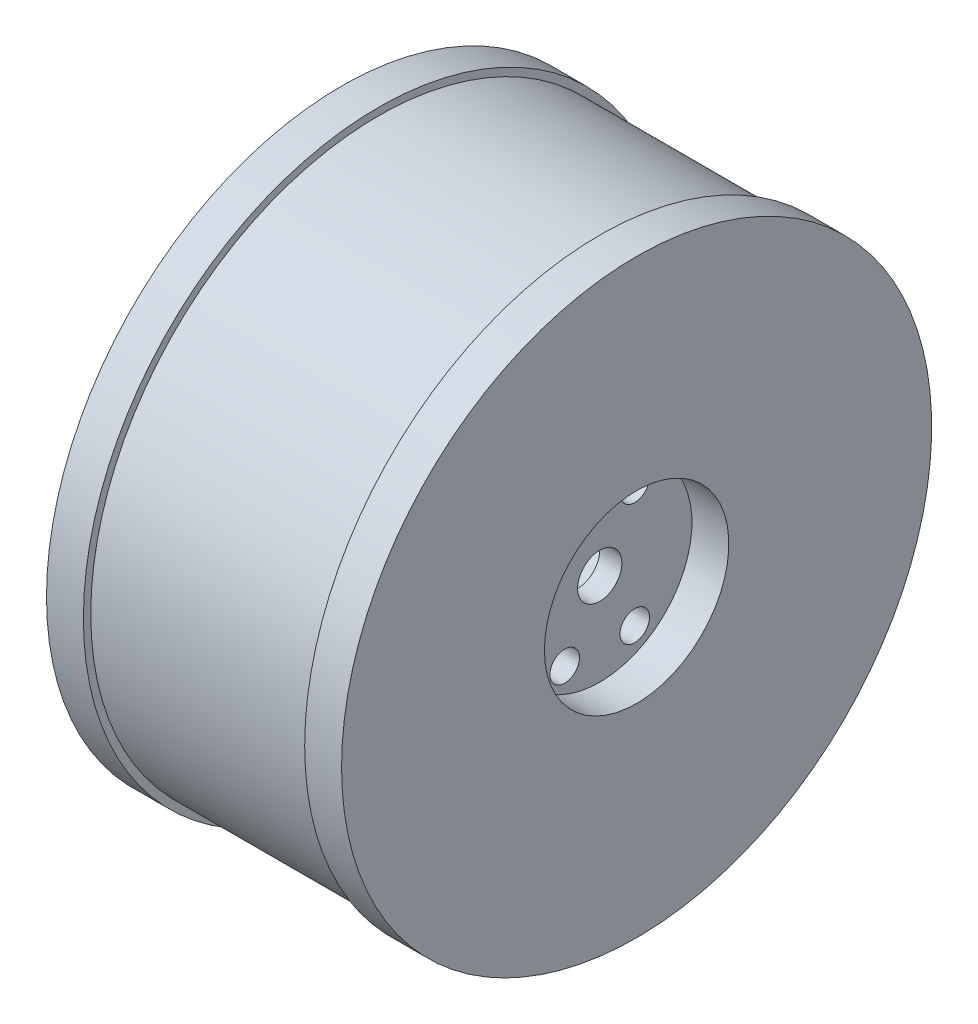
ISO-10303-21;
HEADER;
FILE_DESCRIPTION(('STEP AP214'),'2;1');
FILE_NAME('part.step','',(''),(''),'','','');
FILE_SCHEMA(('AUTOMOTIVE_DESIGN { 1 0 10303 214 1 1 1 1 }'));
ENDSEC;
DATA;
#1=APPLICATION_CONTEXT('core data for automotive mechanical design processes');
#2=APPLICATION_PROTOCOL_DEFINITION('international standard','automotive_design',2000,#1);
#3=PRODUCT_CONTEXT('',#1,'mechanical');
#4=PRODUCT('Part','Part','',(#3));
#5=PRODUCT_RELATED_PRODUCT_CATEGORY('part','',(#4));
#6=PRODUCT_DEFINITION_FORMATION('','',#4);
#7=PRODUCT_DEFINITION_CONTEXT('part definition',#1,'design');
#8=PRODUCT_DEFINITION('design','',#6,#7);
#9=PRODUCT_DEFINITION_SHAPE('','',#8);
#10=(LENGTH_UNIT() NAMED_UNIT(*) SI_UNIT(.MILLI.,.METRE.));
#11=(NAMED_UNIT(*) PLANE_ANGLE_UNIT() SI_UNIT($,.RADIAN.));
#12=(NAMED_UNIT(*) SI_UNIT($,.STERADIAN.) SOLID_ANGLE_UNIT());
#13=UNCERTAINTY_MEASURE_WITH_UNIT(LENGTH_MEASURE(1.E-05),#10,'distance_accuracy_value','');
#14=(GEOMETRIC_REPRESENTATION_CONTEXT(3) GLOBAL_UNCERTAINTY_ASSIGNED_CONTEXT((#13)) GLOBAL_UNIT_ASSIGNED_CONTEXT((#10,
#11,#12)) REPRESENTATION_CONTEXT('',''));
#15=CARTESIAN_POINT('',(0.,0.,0.));
#16=DIRECTION('',(0.,0.,1.));
#17=DIRECTION('',(1.,0.,0.));
#18=AXIS2_PLACEMENT_3D('',#15,#16,#17);
#19=CARTESIAN_POINT('',(-49.6444990272902,0.,0.));
#20=DIRECTION('',(-1.,0.,0.));
#21=DIRECTION('',(0.,0.,1.));
#22=AXIS2_PLACEMENT_3D('',#19,#20,#21);
#23=CYLINDRICAL_SURFACE('',#22,34.);
#24=CARTESIAN_POINT('',(0.,0.,0.));
#25=DIRECTION('',(-1.,0.,0.));
#26=DIRECTION('',(0.,0.,1.));
#27=AXIS2_PLACEMENT_3D('',#24,#25,#26);
#28=CIRCLE('',#27,34.);
#29=CARTESIAN_POINT('',(0.,0.,34.));
#30=VERTEX_POINT('',#29);
#31=EDGE_CURVE('E58',#30,#30,#28,.T.);
#32=ORIENTED_EDGE('',*,*,#31,.F.);
#33=EDGE_LOOP('',(#32));
#34=FACE_BOUND('',#33,.T.);
#35=CARTESIAN_POINT('',(-32.,0.,0.));
#36=DIRECTION('',(-1.,0.,0.));
#37=DIRECTION('',(0.,0.,1.));
#38=AXIS2_PLACEMENT_3D('',#35,#36,#37);
#39=CIRCLE('',#38,34.);
#40=CARTESIAN_POINT('',(-32.,0.,34.));
#41=VERTEX_POINT('',#40);
#42=EDGE_CURVE('E10',#41,#41,#39,.T.);
#43=ORIENTED_EDGE('',*,*,#42,.T.);
#44=EDGE_LOOP('',(#43));
#45=FACE_BOUND('',#44,.T.);
#46=ADVANCED_FACE('F30',(#34,#45),#23,.F.);
#47=CARTESIAN_POINT('',(-32.,34.,0.));
#48=DIRECTION('',(1.,0.,0.));
#49=DIRECTION('',(0.,0.,-1.));
#50=AXIS2_PLACEMENT_3D('',#47,#48,#49);
#51=PLANE('',#50);
#52=ORIENTED_EDGE('',*,*,#42,.F.);
#53=EDGE_LOOP('',(#52));
#54=FACE_BOUND('',#53,.T.);
#55=CARTESIAN_POINT('',(-32.,0.,0.));
#56=DIRECTION('',(-1.,0.,0.));
#57=DIRECTION('',(0.,0.,1.));
#58=AXIS2_PLACEMENT_3D('',#55,#56,#57);
#59=CIRCLE('',#58,40.);
#60=CARTESIAN_POINT('',(-32.,0.,40.));
#61=VERTEX_POINT('',#60);
#62=EDGE_CURVE('E36',#61,#61,#59,.T.);
#63=ORIENTED_EDGE('',*,*,#62,.T.);
#64=EDGE_LOOP('',(#63));
#65=FACE_BOUND('',#64,.T.);
#66=ADVANCED_FACE('F142',(#54,#65),#51,.F.);
#67=CARTESIAN_POINT('',(-49.6444990272902,0.,0.));
#68=DIRECTION('',(-1.,0.,0.));
#69=DIRECTION('',(0.,0.,1.));
#70=AXIS2_PLACEMENT_3D('',#67,#68,#69);
#71=CYLINDRICAL_SURFACE('',#70,40.);
#72=ORIENTED_EDGE('',*,*,#62,.F.);
#73=EDGE_LOOP('',(#72));
#74=FACE_BOUND('',#73,.T.);
#75=CARTESIAN_POINT('',(-27.,0.,0.));
#76=DIRECTION('',(-1.,0.,0.));
#77=DIRECTION('',(0.,0.,1.));
#78=AXIS2_PLACEMENT_3D('',#75,#76,#77);
#79=CIRCLE('',#78,40.);
#80=CARTESIAN_POINT('',(-27.,0.,40.));
#81=VERTEX_POINT('',#80);
#82=EDGE_CURVE('E40',#81,#81,#79,.T.);
#83=ORIENTED_EDGE('',*,*,#82,.T.);
#84=EDGE_LOOP('',(#83));
#85=FACE_BOUND('',#84,.T.);
#86=ADVANCED_FACE('F147',(#74,#85),#71,.T.);
#87=CARTESIAN_POINT('',(-27.,40.,0.));
#88=DIRECTION('',(-1.,0.,0.));
#89=DIRECTION('',(0.,0.,1.));
#90=AXIS2_PLACEMENT_3D('',#87,#88,#89);
#91=PLANE('',#90);
#92=ORIENTED_EDGE('',*,*,#82,.F.);
#93=EDGE_LOOP('',(#92));
#94=FACE_BOUND('',#93,.T.);
#95=CARTESIAN_POINT('',(-27.,0.,0.));
#96=DIRECTION('',(-1.,0.,0.));
#97=DIRECTION('',(0.,0.,1.));
#98=AXIS2_PLACEMENT_3D('',#95,#96,#97);
#99=CIRCLE('',#98,39.);
#100=CARTESIAN_POINT('',(-27.,0.,39.));
#101=VERTEX_POINT('',#100);
#102=EDGE_CURVE('E44',#101,#101,#99,.T.);
#103=ORIENTED_EDGE('',*,*,#102,.T.);
#104=EDGE_LOOP('',(#103));
#105=FACE_BOUND('',#104,.T.);
#106=ADVANCED_FACE('F226',(#94,#105),#91,.F.);
#107=CARTESIAN_POINT('',(-49.6444990272902,0.,0.));
#108=DIRECTION('',(-1.,0.,0.));
#109=DIRECTION('',(0.,0.,1.));
#110=AXIS2_PLACEMENT_3D('',#107,#108,#109);
#111=CYLINDRICAL_SURFACE('',#110,39.);
#112=ORIENTED_EDGE('',*,*,#102,.F.);
#113=EDGE_LOOP('',(#112));
#114=FACE_BOUND('',#113,.T.);
#115=CARTESIAN_POINT('',(3.,0.,0.));
#116=DIRECTION('',(-1.,0.,0.));
#117=DIRECTION('',(0.,0.,1.));
#118=AXIS2_PLACEMENT_3D('',#115,#116,#117);
#119=CIRCLE('',#118,39.);
#120=CARTESIAN_POINT('',(3.,0.,39.));
#121=VERTEX_POINT('',#120);
#122=EDGE_CURVE('E49',#121,#121,#119,.T.);
#123=ORIENTED_EDGE('',*,*,#122,.T.);
#124=EDGE_LOOP('',(#123));
#125=FACE_BOUND('',#124,.T.);
#126=ADVANCED_FACE('F137',(#114,#125),#111,.T.);
#127=CARTESIAN_POINT('',(3.,39.,0.));
#128=DIRECTION('',(1.,0.,0.));
#129=DIRECTION('',(0.,0.,-1.));
#130=AXIS2_PLACEMENT_3D('',#127,#128,#129);
#131=PLANE('',#130);
#132=ORIENTED_EDGE('',*,*,#122,.F.);
#133=EDGE_LOOP('',(#132));
#134=FACE_BOUND('',#133,.T.);
#135=CARTESIAN_POINT('',(3.,0.,0.));
#136=DIRECTION('',(-1.,0.,0.));
#137=DIRECTION('',(0.,0.,1.));
#138=AXIS2_PLACEMENT_3D('',#135,#136,#137);
#139=CIRCLE('',#138,40.);
#140=CARTESIAN_POINT('',(3.,0.,40.));
#141=VERTEX_POINT('',#140);
#142=EDGE_CURVE('E52',#141,#141,#139,.T.);
#143=ORIENTED_EDGE('',*,*,#142,.T.);
#144=EDGE_LOOP('',(#143));
#145=FACE_BOUND('',#144,.T.);
#146=ADVANCED_FACE('F131',(#134,#145),#131,.F.);
#147=CARTESIAN_POINT('',(-49.6444990272902,0.,0.));
#148=DIRECTION('',(-1.,0.,0.));
#149=DIRECTION('',(0.,0.,1.));
#150=AXIS2_PLACEMENT_3D('',#147,#148,#149);
#151=CYLINDRICAL_SURFACE('',#150,40.);
#152=ORIENTED_EDGE('',*,*,#142,.F.);
#153=EDGE_LOOP('',(#152));
#154=FACE_BOUND('',#153,.T.);
#155=CARTESIAN_POINT('',(8.,0.,0.));
#156=DIRECTION('',(-1.,0.,0.));
#157=DIRECTION('',(0.,0.,1.));
#158=AXIS2_PLACEMENT_3D('',#155,#156,#157);
#159=CIRCLE('',#158,40.);
#160=CARTESIAN_POINT('',(8.,0.,40.));
#161=VERTEX_POINT('',#160);
#162=EDGE_CURVE('E55',#161,#161,#159,.T.);
#163=ORIENTED_EDGE('',*,*,#162,.T.);
#164=EDGE_LOOP('',(#163));
#165=FACE_BOUND('',#164,.T.);
#166=ADVANCED_FACE('F126',(#154,#165),#151,.T.);
#167=CARTESIAN_POINT('',(8.,40.,0.));
#168=DIRECTION('',(-1.,0.,0.));
#169=DIRECTION('',(0.,0.,1.));
#170=AXIS2_PLACEMENT_3D('',#167,#168,#169);
#171=PLANE('',#170);
#172=CARTESIAN_POINT('',(8.,0.,0.));
#173=DIRECTION('',(-1.,0.,0.));
#174=DIRECTION('',(0.,0.,1.));
#175=AXIS2_PLACEMENT_3D('',#172,#173,#174);
#176=CIRCLE('',#175,12.5);
#177=CARTESIAN_POINT('',(8.,0.,12.5));
#178=VERTEX_POINT('',#177);
#179=EDGE_CURVE('E61',#178,#178,#176,.T.);
#180=ORIENTED_EDGE('',*,*,#179,.T.);
#181=EDGE_LOOP('',(#180));
#182=FACE_BOUND('',#181,.T.);
#183=ORIENTED_EDGE('',*,*,#162,.F.);
#184=EDGE_LOOP('',(#183));
#185=FACE_BOUND('',#184,.T.);
#186=ADVANCED_FACE('F123',(#182,#185),#171,.F.);
#187=CARTESIAN_POINT('',(0.,34.,0.));
#188=DIRECTION('',(1.,0.,0.));
#189=DIRECTION('',(0.,0.,-1.));
#190=AXIS2_PLACEMENT_3D('',#187,#188,#189);
#191=PLANE('',#190);
#192=CARTESIAN_POINT('',(0.,0.,0.));
#193=DIRECTION('',(1.,0.,0.));
#194=DIRECTION('',(0.,0.,-1.));
#195=AXIS2_PLACEMENT_3D('',#192,#193,#194);
#196=CIRCLE('',#195,3.);
#197=CARTESIAN_POINT('',(0.,0.,-3.));
#198=VERTEX_POINT('',#197);
#199=EDGE_CURVE('E91',#198,#198,#196,.T.);
#200=ORIENTED_EDGE('',*,*,#199,.T.);
#201=EDGE_LOOP('',(#200));
#202=FACE_BOUND('',#201,.T.);
#203=CARTESIAN_POINT('',(0.,8.22724133595216,4.75000000000001));
#204=DIRECTION('',(1.,0.,0.));
#205=DIRECTION('',(0.,0.,-1.));
#206=AXIS2_PLACEMENT_3D('',#203,#204,#205);
#207=CIRCLE('',#206,2.);
#208=CARTESIAN_POINT('',(0.,8.22724133595216,2.75000000000001));
#209=VERTEX_POINT('',#208);
#210=EDGE_CURVE('E67',#209,#209,#207,.T.);
#211=ORIENTED_EDGE('',*,*,#210,.T.);
#212=EDGE_LOOP('',(#211));
#213=FACE_BOUND('',#212,.T.);
#214=CARTESIAN_POINT('',(0.,-8.22724133595216,-4.75000000000001));
#215=DIRECTION('',(1.,0.,0.));
#216=DIRECTION('',(0.,0.,-1.));
#217=AXIS2_PLACEMENT_3D('',#214,#215,#216);
#218=CIRCLE('',#217,2.);
#219=CARTESIAN_POINT('',(0.,-8.22724133595216,-6.75000000000001));
#220=VERTEX_POINT('',#219);
#221=EDGE_CURVE('E70',#220,#220,#218,.T.);
#222=ORIENTED_EDGE('',*,*,#221,.T.);
#223=EDGE_LOOP('',(#222));
#224=FACE_BOUND('',#223,.T.);
#225=CARTESIAN_POINT('',(0.,-8.22724133595216,4.75000000000001));
#226=DIRECTION('',(1.,0.,0.));
#227=DIRECTION('',(0.,0.,-1.));
#228=AXIS2_PLACEMENT_3D('',#225,#226,#227);
#229=CIRCLE('',#228,2.);
#230=CARTESIAN_POINT('',(0.,-8.22724133595216,2.75000000000001));
#231=VERTEX_POINT('',#230);
#232=EDGE_CURVE('E73',#231,#231,#229,.T.);
#233=ORIENTED_EDGE('',*,*,#232,.T.);
#234=EDGE_LOOP('',(#233));
#235=FACE_BOUND('',#234,.T.);
#236=CARTESIAN_POINT('',(0.,8.22724133595216,-4.75000000000001));
#237=DIRECTION('',(1.,0.,0.));
#238=DIRECTION('',(0.,0.,-1.));
#239=AXIS2_PLACEMENT_3D('',#236,#237,#238);
#240=CIRCLE('',#239,2.);
#241=CARTESIAN_POINT('',(0.,8.22724133595216,-6.75000000000001));
#242=VERTEX_POINT('',#241);
#243=EDGE_CURVE('E76',#242,#242,#240,.T.);
#244=ORIENTED_EDGE('',*,*,#243,.T.);
#245=EDGE_LOOP('',(#244));
#246=FACE_BOUND('',#245,.T.);
#247=ORIENTED_EDGE('',*,*,#31,.T.);
#248=EDGE_LOOP('',(#247));
#249=FACE_BOUND('',#248,.T.);
#250=ADVANCED_FACE('F119',(#202,#213,#224,#235,#246,#249),#191,.F.);
#251=CARTESIAN_POINT('',(0.,0.,0.));
#252=DIRECTION('',(-1.,0.,0.));
#253=DIRECTION('',(0.,0.,1.));
#254=AXIS2_PLACEMENT_3D('',#251,#252,#253);
#255=CYLINDRICAL_SURFACE('',#254,12.5);
#256=CARTESIAN_POINT('',(3.,0.,0.));
#257=DIRECTION('',(-1.,0.,0.));
#258=DIRECTION('',(0.,0.,1.));
#259=AXIS2_PLACEMENT_3D('',#256,#257,#258);
#260=CIRCLE('',#259,12.5);
#261=CARTESIAN_POINT('',(3.,0.,12.5));
#262=VERTEX_POINT('',#261);
#263=EDGE_CURVE('E64',#262,#262,#260,.T.);
#264=ORIENTED_EDGE('',*,*,#263,.T.);
#265=EDGE_LOOP('',(#264));
#266=FACE_BOUND('',#265,.T.);
#267=ORIENTED_EDGE('',*,*,#179,.F.);
#268=EDGE_LOOP('',(#267));
#269=FACE_BOUND('',#268,.T.);
#270=ADVANCED_FACE('F105',(#266,#269),#255,.F.);
#271=CARTESIAN_POINT('',(3.,12.5,0.));
#272=DIRECTION('',(1.,0.,0.));
#273=DIRECTION('',(0.,0.,-1.));
#274=AXIS2_PLACEMENT_3D('',#271,#272,#273);
#275=PLANE('',#274);
#276=CARTESIAN_POINT('',(3.,0.,0.));
#277=DIRECTION('',(1.,0.,0.));
#278=DIRECTION('',(0.,0.,-1.));
#279=AXIS2_PLACEMENT_3D('',#276,#277,#278);
#280=CIRCLE('',#279,3.);
#281=CARTESIAN_POINT('',(3.,0.,-3.));
#282=VERTEX_POINT('',#281);
#283=EDGE_CURVE('E94',#282,#282,#280,.T.);
#284=ORIENTED_EDGE('',*,*,#283,.F.);
#285=EDGE_LOOP('',(#284));
#286=FACE_BOUND('',#285,.T.);
#287=CARTESIAN_POINT('',(3.,8.22724133595216,4.75000000000001));
#288=DIRECTION('',(1.,0.,0.));
#289=DIRECTION('',(0.,0.,1.));
#290=AXIS2_PLACEMENT_3D('',#287,#288,#289);
#291=CIRCLE('',#290,2.);
#292=CARTESIAN_POINT('',(3.,8.22724133595216,6.75000000000001));
#293=VERTEX_POINT('',#292);
#294=EDGE_CURVE('E82',#293,#293,#291,.T.);
#295=ORIENTED_EDGE('',*,*,#294,.F.);
#296=EDGE_LOOP('',(#295));
#297=FACE_BOUND('',#296,.T.);
#298=CARTESIAN_POINT('',(3.,-8.22724133595216,-4.75000000000001));
#299=DIRECTION('',(1.,0.,0.));
#300=DIRECTION('',(0.,0.,1.));
#301=AXIS2_PLACEMENT_3D('',#298,#299,#300);
#302=CIRCLE('',#301,2.);
#303=CARTESIAN_POINT('',(3.,-8.22724133595216,-2.75000000000001));
#304=VERTEX_POINT('',#303);
#305=EDGE_CURVE('E83',#304,#304,#302,.T.);
#306=ORIENTED_EDGE('',*,*,#305,.F.);
#307=EDGE_LOOP('',(#306));
#308=FACE_BOUND('',#307,.T.);
#309=CARTESIAN_POINT('',(3.,-8.22724133595216,4.75000000000001));
#310=DIRECTION('',(1.,0.,0.));
#311=DIRECTION('',(0.,0.,-1.));
#312=AXIS2_PLACEMENT_3D('',#309,#310,#311);
#313=CIRCLE('',#312,2.);
#314=CARTESIAN_POINT('',(3.,-8.22724133595216,2.75000000000001));
#315=VERTEX_POINT('',#314);
#316=EDGE_CURVE('E86',#315,#315,#313,.T.);
#317=ORIENTED_EDGE('',*,*,#316,.F.);
#318=EDGE_LOOP('',(#317));
#319=FACE_BOUND('',#318,.T.);
#320=CARTESIAN_POINT('',(3.,8.22724133595216,-4.75000000000001));
#321=DIRECTION('',(1.,0.,0.));
#322=DIRECTION('',(0.,0.,-1.));
#323=AXIS2_PLACEMENT_3D('',#320,#321,#322);
#324=CIRCLE('',#323,2.);
#325=CARTESIAN_POINT('',(3.,8.22724133595216,-6.75000000000001));
#326=VERTEX_POINT('',#325);
#327=EDGE_CURVE('E79',#326,#326,#324,.T.);
#328=ORIENTED_EDGE('',*,*,#327,.F.);
#329=EDGE_LOOP('',(#328));
#330=FACE_BOUND('',#329,.T.);
#331=ORIENTED_EDGE('',*,*,#263,.F.);
#332=EDGE_LOOP('',(#331));
#333=FACE_BOUND('',#332,.T.);
#334=ADVANCED_FACE('F101',(#286,#297,#308,#319,#330,#333),#275,.T.);
#335=CARTESIAN_POINT('',(-32.,8.22724133595216,-4.75000000000001));
#336=DIRECTION('',(1.,0.,0.));
#337=DIRECTION('',(0.,0.,-1.));
#338=AXIS2_PLACEMENT_3D('',#335,#336,#337);
#339=CYLINDRICAL_SURFACE('',#338,2.);
#340=ORIENTED_EDGE('',*,*,#327,.T.);
#341=EDGE_LOOP('',(#340));
#342=FACE_BOUND('',#341,.T.);
#343=ORIENTED_EDGE('',*,*,#243,.F.);
#344=EDGE_LOOP('',(#343));
#345=FACE_BOUND('',#344,.T.);
#346=ADVANCED_FACE('F104',(#342,#345),#339,.F.);
#347=CARTESIAN_POINT('',(-32.,-8.22724133595216,4.75000000000001));
#348=DIRECTION('',(1.,0.,0.));
#349=DIRECTION('',(0.,0.,-1.));
#350=AXIS2_PLACEMENT_3D('',#347,#348,#349);
#351=CYLINDRICAL_SURFACE('',#350,2.);
#352=ORIENTED_EDGE('',*,*,#316,.T.);
#353=EDGE_LOOP('',(#352));
#354=FACE_BOUND('',#353,.T.);
#355=ORIENTED_EDGE('',*,*,#232,.F.);
#356=EDGE_LOOP('',(#355));
#357=FACE_BOUND('',#356,.T.);
#358=ADVANCED_FACE('F160',(#354,#357),#351,.F.);
#359=CARTESIAN_POINT('',(-32.,-8.22724133595216,-4.75000000000001));
#360=DIRECTION('',(1.,0.,0.));
#361=DIRECTION('',(0.,0.,-1.));
#362=AXIS2_PLACEMENT_3D('',#359,#360,#361);
#363=CYLINDRICAL_SURFACE('',#362,2.);
#364=ORIENTED_EDGE('',*,*,#305,.T.);
#365=EDGE_LOOP('',(#364));
#366=FACE_BOUND('',#365,.T.);
#367=ORIENTED_EDGE('',*,*,#221,.F.);
#368=EDGE_LOOP('',(#367));
#369=FACE_BOUND('',#368,.T.);
#370=ADVANCED_FACE('F162',(#366,#369),#363,.F.);
#371=CARTESIAN_POINT('',(-32.,8.22724133595216,4.75000000000001));
#372=DIRECTION('',(1.,0.,0.));
#373=DIRECTION('',(0.,0.,-1.));
#374=AXIS2_PLACEMENT_3D('',#371,#372,#373);
#375=CYLINDRICAL_SURFACE('',#374,2.);
#376=ORIENTED_EDGE('',*,*,#294,.T.);
#377=EDGE_LOOP('',(#376));
#378=FACE_BOUND('',#377,.T.);
#379=ORIENTED_EDGE('',*,*,#210,.F.);
#380=EDGE_LOOP('',(#379));
#381=FACE_BOUND('',#380,.T.);
#382=ADVANCED_FACE('F165',(#378,#381),#375,.F.);
#383=CARTESIAN_POINT('',(-32.,0.,0.));
#384=DIRECTION('',(1.,0.,0.));
#385=DIRECTION('',(0.,0.,-1.));
#386=AXIS2_PLACEMENT_3D('',#383,#384,#385);
#387=CYLINDRICAL_SURFACE('',#386,3.);
#388=ORIENTED_EDGE('',*,*,#283,.T.);
#389=EDGE_LOOP('',(#388));
#390=FACE_BOUND('',#389,.T.);
#391=ORIENTED_EDGE('',*,*,#199,.F.);
#392=EDGE_LOOP('',(#391));
#393=FACE_BOUND('',#392,.T.);
#394=ADVANCED_FACE('F98',(#390,#393),#387,.F.);
#395=CLOSED_SHELL('',(#46,#66,#86,#106,#126,#146,#166,#186,#250,#270,#334,#346,#358,#370,#382,#394));
#396=MANIFOLD_SOLID_BREP('B2',#395);
#397=ADVANCED_BREP_SHAPE_REPRESENTATION('',(#18,#396),#14);
#398=SHAPE_DEFINITION_REPRESENTATION(#9,#397);
ENDSEC;
END-ISO-10303-21;
